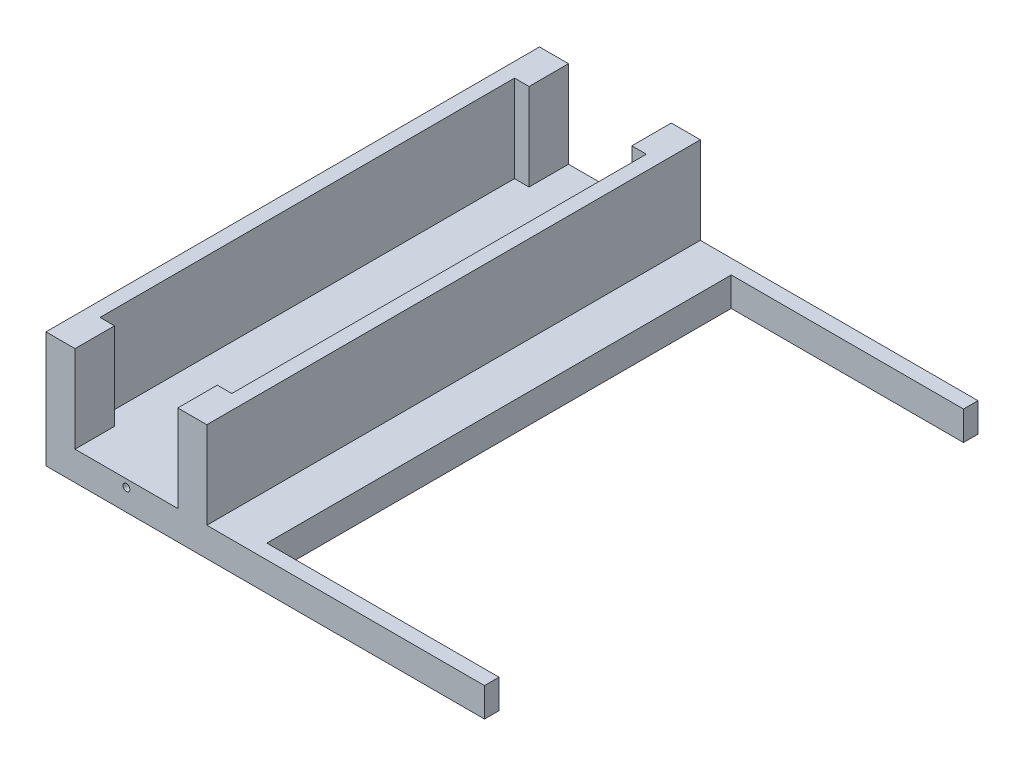
ISO-10303-21;
HEADER;
FILE_DESCRIPTION(('STEP AP214'),'2;1');
FILE_NAME('part.step','',(''),(''),'','','');
FILE_SCHEMA(('AUTOMOTIVE_DESIGN { 1 0 10303 214 1 1 1 1 }'));
ENDSEC;
DATA;
#1=APPLICATION_CONTEXT('core data for automotive mechanical design processes');
#2=APPLICATION_PROTOCOL_DEFINITION('international standard','automotive_design',2000,#1);
#3=PRODUCT_CONTEXT('',#1,'mechanical');
#4=PRODUCT('Part','Part','',(#3));
#5=PRODUCT_RELATED_PRODUCT_CATEGORY('part','',(#4));
#6=PRODUCT_DEFINITION_FORMATION('','',#4);
#7=PRODUCT_DEFINITION_CONTEXT('part definition',#1,'design');
#8=PRODUCT_DEFINITION('design','',#6,#7);
#9=PRODUCT_DEFINITION_SHAPE('','',#8);
#10=(LENGTH_UNIT() NAMED_UNIT(*) SI_UNIT(.MILLI.,.METRE.));
#11=(NAMED_UNIT(*) PLANE_ANGLE_UNIT() SI_UNIT($,.RADIAN.));
#12=(NAMED_UNIT(*) SI_UNIT($,.STERADIAN.) SOLID_ANGLE_UNIT());
#13=UNCERTAINTY_MEASURE_WITH_UNIT(LENGTH_MEASURE(1.E-05),#10,'distance_accuracy_value','');
#14=(GEOMETRIC_REPRESENTATION_CONTEXT(3) GLOBAL_UNCERTAINTY_ASSIGNED_CONTEXT((#13)) GLOBAL_UNIT_ASSIGNED_CONTEXT((#10,
#11,#12)) REPRESENTATION_CONTEXT('',''));
#15=CARTESIAN_POINT('',(0.,0.,0.));
#16=DIRECTION('',(0.,0.,1.));
#17=DIRECTION('',(1.,0.,0.));
#18=AXIS2_PLACEMENT_3D('',#15,#16,#17);
#19=CARTESIAN_POINT('',(0.,0.,0.));
#20=DIRECTION('',(0.,1.,0.));
#21=DIRECTION('',(0.,0.,1.));
#22=AXIS2_PLACEMENT_3D('',#19,#20,#21);
#23=PLANE('',#22);
#24=DIRECTION('',(0.,0.,1.));
#25=VECTOR('',#24,1.);
#26=CARTESIAN_POINT('',(-33.0034526155511,0.,0.));
#27=LINE('',#26,#25);
#28=CARTESIAN_POINT('',(-33.0034526155511,0.,-53.975));
#29=VERTEX_POINT('',#28);
#30=CARTESIAN_POINT('',(-33.0034526155511,0.,-50.8));
#31=VERTEX_POINT('',#30);
#32=EDGE_CURVE('E115',#29,#31,#27,.T.);
#33=ORIENTED_EDGE('',*,*,#32,.F.);
#34=DIRECTION('',(1.,0.,0.));
#35=VECTOR('',#34,1.);
#36=CARTESIAN_POINT('',(0.,0.,-53.975));
#37=LINE('',#36,#35);
#38=CARTESIAN_POINT('',(-93.7425473844489,0.,-53.975));
#39=VERTEX_POINT('',#38);
#40=EDGE_CURVE('E468',#39,#29,#37,.T.);
#41=ORIENTED_EDGE('',*,*,#40,.F.);
#42=DIRECTION('',(0.,0.,1.));
#43=VECTOR('',#42,1.);
#44=CARTESIAN_POINT('',(-93.7425473844489,0.,0.));
#45=LINE('',#44,#43);
#46=CARTESIAN_POINT('',(-93.7425473844489,0.,53.975));
#47=VERTEX_POINT('',#46);
#48=EDGE_CURVE('E301',#39,#47,#45,.T.);
#49=ORIENTED_EDGE('',*,*,#48,.T.);
#50=DIRECTION('',(1.,0.,0.));
#51=VECTOR('',#50,1.);
#52=CARTESIAN_POINT('',(0.,0.,53.975));
#53=LINE('',#52,#51);
#54=CARTESIAN_POINT('',(-33.0034526155511,0.,53.975));
#55=VERTEX_POINT('',#54);
#56=EDGE_CURVE('E452',#47,#55,#53,.T.);
#57=ORIENTED_EDGE('',*,*,#56,.T.);
#58=CARTESIAN_POINT('',(-33.0034526155511,0.,50.8));
#59=VERTEX_POINT('',#58);
#60=EDGE_CURVE('E503',#59,#55,#27,.T.);
#61=ORIENTED_EDGE('',*,*,#60,.F.);
#62=DIRECTION('',(1.,0.,0.));
#63=VECTOR('',#62,1.);
#64=CARTESIAN_POINT('',(0.,0.,50.8));
#65=LINE('',#64,#63);
#66=CARTESIAN_POINT('',(-83.8034526155511,0.,50.8));
#67=VERTEX_POINT('',#66);
#68=EDGE_CURVE('E261',#67,#59,#65,.T.);
#69=ORIENTED_EDGE('',*,*,#68,.F.);
#70=DIRECTION('',(0.,0.,1.));
#71=VECTOR('',#70,1.);
#72=CARTESIAN_POINT('',(-83.8034526155511,0.,0.));
#73=LINE('',#72,#71);
#74=CARTESIAN_POINT('',(-83.8034526155511,0.,-50.8));
#75=VERTEX_POINT('',#74);
#76=EDGE_CURVE('E268',#75,#67,#73,.T.);
#77=ORIENTED_EDGE('',*,*,#76,.F.);
#78=DIRECTION('',(1.,0.,0.));
#79=VECTOR('',#78,1.);
#80=CARTESIAN_POINT('',(0.,0.,-50.8));
#81=LINE('',#80,#79);
#82=EDGE_CURVE('E277',#75,#31,#81,.T.);
#83=ORIENTED_EDGE('',*,*,#82,.T.);
#84=EDGE_LOOP('',(#33,#41,#49,#57,#61,#69,#77,#83));
#85=FACE_BOUND('',#84,.T.);
#86=ADVANCED_FACE('F92',(#85),#23,.T.);
#87=CARTESIAN_POINT('',(0.,-6.35,0.));
#88=DIRECTION('',(0.,1.,0.));
#89=DIRECTION('',(0.,0.,1.));
#90=AXIS2_PLACEMENT_3D('',#87,#88,#89);
#91=PLANE('',#90);
#92=DIRECTION('',(1.,0.,0.));
#93=VECTOR('',#92,1.);
#94=CARTESIAN_POINT('',(0.,-6.35,-53.975));
#95=LINE('',#94,#93);
#96=CARTESIAN_POINT('',(-128.921547384449,-6.35,-53.975));
#97=VERTEX_POINT('',#96);
#98=CARTESIAN_POINT('',(-33.0034526155511,-6.35,-53.975));
#99=VERTEX_POINT('',#98);
#100=EDGE_CURVE('E253',#97,#99,#95,.T.);
#101=ORIENTED_EDGE('',*,*,#100,.T.);
#102=DIRECTION('',(0.,0.,1.));
#103=VECTOR('',#102,1.);
#104=CARTESIAN_POINT('',(-33.0034526155511,-6.35,0.));
#105=LINE('',#104,#103);
#106=CARTESIAN_POINT('',(-33.0034526155511,-6.35,-50.8));
#107=VERTEX_POINT('',#106);
#108=EDGE_CURVE('E240',#99,#107,#105,.T.);
#109=ORIENTED_EDGE('',*,*,#108,.T.);
#110=DIRECTION('',(1.,0.,0.));
#111=VECTOR('',#110,1.);
#112=CARTESIAN_POINT('',(0.,-6.35,-50.8));
#113=LINE('',#112,#111);
#114=CARTESIAN_POINT('',(-83.8034526155511,-6.35,-50.8));
#115=VERTEX_POINT('',#114);
#116=EDGE_CURVE('E251',#115,#107,#113,.T.);
#117=ORIENTED_EDGE('',*,*,#116,.F.);
#118=DIRECTION('',(0.,0.,1.));
#119=VECTOR('',#118,1.);
#120=CARTESIAN_POINT('',(-83.8034526155511,-6.35,0.));
#121=LINE('',#120,#119);
#122=CARTESIAN_POINT('',(-83.8034526155511,-6.35,50.8));
#123=VERTEX_POINT('',#122);
#124=EDGE_CURVE('E260',#115,#123,#121,.T.);
#125=ORIENTED_EDGE('',*,*,#124,.T.);
#126=DIRECTION('',(1.,0.,0.));
#127=VECTOR('',#126,1.);
#128=CARTESIAN_POINT('',(0.,-6.35,50.8));
#129=LINE('',#128,#127);
#130=CARTESIAN_POINT('',(-33.0034526155511,-6.35,50.8));
#131=VERTEX_POINT('',#130);
#132=EDGE_CURVE('E265',#123,#131,#129,.T.);
#133=ORIENTED_EDGE('',*,*,#132,.T.);
#134=CARTESIAN_POINT('',(-33.0034526155511,-6.35,53.975));
#135=VERTEX_POINT('',#134);
#136=EDGE_CURVE('E108',#131,#135,#105,.T.);
#137=ORIENTED_EDGE('',*,*,#136,.T.);
#138=DIRECTION('',(1.,0.,0.));
#139=VECTOR('',#138,1.);
#140=CARTESIAN_POINT('',(0.,-6.35,53.975));
#141=LINE('',#140,#139);
#142=CARTESIAN_POINT('',(-128.921547384449,-6.35,53.975));
#143=VERTEX_POINT('',#142);
#144=EDGE_CURVE('E456',#143,#135,#141,.T.);
#145=ORIENTED_EDGE('',*,*,#144,.F.);
#146=DIRECTION('',(0.,0.,-1.));
#147=VECTOR('',#146,1.);
#148=CARTESIAN_POINT('',(-128.921547384449,-6.35,0.));
#149=LINE('',#148,#147);
#150=EDGE_CURVE('E453',#143,#97,#149,.T.);
#151=ORIENTED_EDGE('',*,*,#150,.T.);
#152=EDGE_LOOP('',(#101,#109,#117,#125,#133,#137,#145,#151));
#153=FACE_BOUND('',#152,.T.);
#154=ADVANCED_FACE('F249',(#153),#91,.F.);
#155=DIRECTION('',(1.,0.,0.));
#156=VECTOR('',#155,1.);
#157=CARTESIAN_POINT('',(0.,0.,-45.339));
#158=LINE('',#157,#156);
#159=CARTESIAN_POINT('',(-100.092547384449,0.,-45.339));
#160=VERTEX_POINT('',#159);
#161=CARTESIAN_POINT('',(-96.9175473844489,0.,-45.339));
#162=VERTEX_POINT('',#161);
#163=EDGE_CURVE('E342',#160,#162,#158,.T.);
#164=ORIENTED_EDGE('',*,*,#163,.F.);
#165=DIRECTION('',(0.,0.,1.));
#166=VECTOR('',#165,1.);
#167=CARTESIAN_POINT('',(-100.092547384449,0.,0.));
#168=LINE('',#167,#166);
#169=CARTESIAN_POINT('',(-100.092547384449,0.,-53.975));
#170=VERTEX_POINT('',#169);
#171=EDGE_CURVE('E339',#170,#160,#168,.T.);
#172=ORIENTED_EDGE('',*,*,#171,.F.);
#173=CARTESIAN_POINT('',(-122.571547384449,0.,-53.975));
#174=VERTEX_POINT('',#173);
#175=EDGE_CURVE('E457',#174,#170,#37,.T.);
#176=ORIENTED_EDGE('',*,*,#175,.F.);
#177=DIRECTION('',(0.,0.,1.));
#178=VECTOR('',#177,1.);
#179=CARTESIAN_POINT('',(-122.571547384449,0.,0.));
#180=LINE('',#179,#178);
#181=CARTESIAN_POINT('',(-122.571547384449,0.,-45.339));
#182=VERTEX_POINT('',#181);
#183=EDGE_CURVE('E382',#174,#182,#180,.T.);
#184=ORIENTED_EDGE('',*,*,#183,.T.);
#185=DIRECTION('',(1.,0.,0.));
#186=VECTOR('',#185,1.);
#187=CARTESIAN_POINT('',(0.,0.,-45.339));
#188=LINE('',#187,#186);
#189=CARTESIAN_POINT('',(-125.746547384449,0.,-45.339));
#190=VERTEX_POINT('',#189);
#191=EDGE_CURVE('E388',#190,#182,#188,.T.);
#192=ORIENTED_EDGE('',*,*,#191,.F.);
#193=DIRECTION('',(0.,0.,-1.));
#194=VECTOR('',#193,1.);
#195=CARTESIAN_POINT('',(-125.746547384449,0.,0.));
#196=LINE('',#195,#194);
#197=CARTESIAN_POINT('',(-125.746547384449,0.,45.339));
#198=VERTEX_POINT('',#197);
#199=EDGE_CURVE('E422',#198,#190,#196,.T.);
#200=ORIENTED_EDGE('',*,*,#199,.F.);
#201=DIRECTION('',(1.,0.,0.));
#202=VECTOR('',#201,1.);
#203=CARTESIAN_POINT('',(0.,0.,45.339));
#204=LINE('',#203,#202);
#205=CARTESIAN_POINT('',(-122.571547384449,0.,45.339));
#206=VERTEX_POINT('',#205);
#207=EDGE_CURVE('E419',#198,#206,#204,.T.);
#208=ORIENTED_EDGE('',*,*,#207,.T.);
#209=DIRECTION('',(0.,0.,-1.));
#210=VECTOR('',#209,1.);
#211=CARTESIAN_POINT('',(-122.571547384449,0.,0.));
#212=LINE('',#211,#210);
#213=CARTESIAN_POINT('',(-122.571547384449,0.,53.975));
#214=VERTEX_POINT('',#213);
#215=EDGE_CURVE('E415',#214,#206,#212,.T.);
#216=ORIENTED_EDGE('',*,*,#215,.F.);
#217=CARTESIAN_POINT('',(-100.092547384449,0.,53.975));
#218=VERTEX_POINT('',#217);
#219=EDGE_CURVE('E464',#214,#218,#53,.T.);
#220=ORIENTED_EDGE('',*,*,#219,.T.);
#221=DIRECTION('',(0.,0.,-1.));
#222=VECTOR('',#221,1.);
#223=CARTESIAN_POINT('',(-100.092547384449,0.,0.));
#224=LINE('',#223,#222);
#225=CARTESIAN_POINT('',(-100.092547384449,0.,45.339));
#226=VERTEX_POINT('',#225);
#227=EDGE_CURVE('E310',#218,#226,#224,.T.);
#228=ORIENTED_EDGE('',*,*,#227,.T.);
#229=DIRECTION('',(1.,0.,0.));
#230=VECTOR('',#229,1.);
#231=CARTESIAN_POINT('',(0.,0.,45.339));
#232=LINE('',#231,#230);
#233=CARTESIAN_POINT('',(-96.9175473844489,0.,45.339));
#234=VERTEX_POINT('',#233);
#235=EDGE_CURVE('E350',#226,#234,#232,.T.);
#236=ORIENTED_EDGE('',*,*,#235,.T.);
#237=DIRECTION('',(0.,0.,-1.));
#238=VECTOR('',#237,1.);
#239=CARTESIAN_POINT('',(-96.9175473844489,0.,0.));
#240=LINE('',#239,#238);
#241=EDGE_CURVE('E346',#234,#162,#240,.T.);
#242=ORIENTED_EDGE('',*,*,#241,.T.);
#243=EDGE_LOOP('',(#164,#172,#176,#184,#192,#200,#208,#216,#220,#228,#236,#242));
#244=FACE_BOUND('',#243,.T.);
#245=ADVANCED_FACE('F533',(#244),#23,.T.);
#246=CARTESIAN_POINT('',(-128.921547384449,-6.35,0.));
#247=DIRECTION('',(1.,0.,0.));
#248=DIRECTION('',(0.,0.,-1.));
#249=AXIS2_PLACEMENT_3D('',#246,#247,#248);
#250=PLANE('',#249);
#251=DIRECTION('',(0.,1.,0.));
#252=VECTOR('',#251,1.);
#253=CARTESIAN_POINT('',(-128.921547384449,-6.35,53.975));
#254=LINE('',#253,#252);
#255=CARTESIAN_POINT('',(-128.921547384449,19.05,53.975));
#256=VERTEX_POINT('',#255);
#257=EDGE_CURVE('E463',#143,#256,#254,.T.);
#258=ORIENTED_EDGE('',*,*,#257,.T.);
#259=DIRECTION('',(0.,0.,-1.));
#260=VECTOR('',#259,1.);
#261=CARTESIAN_POINT('',(-128.921547384449,19.05,0.));
#262=LINE('',#261,#260);
#263=CARTESIAN_POINT('',(-128.921547384449,19.05,-53.975));
#264=VERTEX_POINT('',#263);
#265=EDGE_CURVE('E392',#256,#264,#262,.T.);
#266=ORIENTED_EDGE('',*,*,#265,.T.);
#267=DIRECTION('',(0.,1.,0.));
#268=VECTOR('',#267,1.);
#269=CARTESIAN_POINT('',(-128.921547384449,-6.35,-53.975));
#270=LINE('',#269,#268);
#271=EDGE_CURVE('E101',#97,#264,#270,.T.);
#272=ORIENTED_EDGE('',*,*,#271,.F.);
#273=ORIENTED_EDGE('',*,*,#150,.F.);
#274=EDGE_LOOP('',(#258,#266,#272,#273));
#275=FACE_BOUND('',#274,.T.);
#276=ADVANCED_FACE('F477',(#275),#250,.F.);
#277=CARTESIAN_POINT('',(0.,-6.35,53.975));
#278=DIRECTION('',(0.,0.,1.));
#279=DIRECTION('',(1.,0.,0.));
#280=AXIS2_PLACEMENT_3D('',#277,#278,#279);
#281=PLANE('',#280);
#282=DIRECTION('',(0.,-1.,0.));
#283=VECTOR('',#282,1.);
#284=CARTESIAN_POINT('',(-33.0034526155511,-6.35,53.975));
#285=LINE('',#284,#283);
#286=EDGE_CURVE('E271',#55,#135,#285,.T.);
#287=ORIENTED_EDGE('',*,*,#286,.F.);
#288=ORIENTED_EDGE('',*,*,#56,.F.);
#289=DIRECTION('',(0.,-1.,0.));
#290=VECTOR('',#289,1.);
#291=CARTESIAN_POINT('',(-93.7425473844489,19.05,53.975));
#292=LINE('',#291,#290);
#293=CARTESIAN_POINT('',(-93.7425473844489,19.05,53.975));
#294=VERTEX_POINT('',#293);
#295=EDGE_CURVE('E335',#294,#47,#292,.T.);
#296=ORIENTED_EDGE('',*,*,#295,.F.);
#297=DIRECTION('',(1.,0.,0.));
#298=VECTOR('',#297,1.);
#299=CARTESIAN_POINT('',(0.,19.05,53.975));
#300=LINE('',#299,#298);
#301=CARTESIAN_POINT('',(-100.092547384449,19.05,53.975));
#302=VERTEX_POINT('',#301);
#303=EDGE_CURVE('E332',#302,#294,#300,.T.);
#304=ORIENTED_EDGE('',*,*,#303,.F.);
#305=DIRECTION('',(0.,-1.,0.));
#306=VECTOR('',#305,1.);
#307=CARTESIAN_POINT('',(-100.092547384449,19.05,53.975));
#308=LINE('',#307,#306);
#309=EDGE_CURVE('E359',#302,#218,#308,.T.);
#310=ORIENTED_EDGE('',*,*,#309,.T.);
#311=ORIENTED_EDGE('',*,*,#219,.F.);
#312=DIRECTION('',(0.,-1.,0.));
#313=VECTOR('',#312,1.);
#314=CARTESIAN_POINT('',(-122.571547384449,19.05,53.975));
#315=LINE('',#314,#313);
#316=CARTESIAN_POINT('',(-122.571547384449,19.05,53.975));
#317=VERTEX_POINT('',#316);
#318=EDGE_CURVE('E444',#317,#214,#315,.T.);
#319=ORIENTED_EDGE('',*,*,#318,.F.);
#320=DIRECTION('',(1.,0.,0.));
#321=VECTOR('',#320,1.);
#322=CARTESIAN_POINT('',(0.,19.05,53.975));
#323=LINE('',#322,#321);
#324=EDGE_CURVE('E396',#256,#317,#323,.T.);
#325=ORIENTED_EDGE('',*,*,#324,.F.);
#326=ORIENTED_EDGE('',*,*,#257,.F.);
#327=ORIENTED_EDGE('',*,*,#144,.T.);
#328=EDGE_LOOP('',(#287,#288,#296,#304,#310,#311,#319,#325,#326,#327));
#329=FACE_BOUND('',#328,.T.);
#330=CARTESIAN_POINT('',(-111.332047384449,-1.651,53.975));
#331=DIRECTION('',(0.,0.,1.));
#332=DIRECTION('',(1.,0.,0.));
#333=AXIS2_PLACEMENT_3D('',#330,#331,#332);
#334=CIRCLE('',#333,0.762000000000003);
#335=CARTESIAN_POINT('',(-110.570047384449,-1.651,53.975));
#336=VERTEX_POINT('',#335);
#337=EDGE_CURVE('E293',#336,#336,#334,.T.);
#338=ORIENTED_EDGE('',*,*,#337,.F.);
#339=EDGE_LOOP('',(#338));
#340=FACE_BOUND('',#339,.T.);
#341=ADVANCED_FACE('F94',(#329,#340),#281,.T.);
#342=CARTESIAN_POINT('',(0.,-6.35,-53.975));
#343=DIRECTION('',(0.,0.,1.));
#344=DIRECTION('',(1.,0.,0.));
#345=AXIS2_PLACEMENT_3D('',#342,#343,#344);
#346=PLANE('',#345);
#347=CARTESIAN_POINT('',(-111.332047384449,-1.651,-53.975));
#348=DIRECTION('',(0.,0.,1.));
#349=DIRECTION('',(1.,0.,0.));
#350=AXIS2_PLACEMENT_3D('',#347,#348,#349);
#351=CIRCLE('',#350,0.762000000000003);
#352=CARTESIAN_POINT('',(-110.570047384449,-1.651,-53.975));
#353=VERTEX_POINT('',#352);
#354=EDGE_CURVE('E286',#353,#353,#351,.T.);
#355=ORIENTED_EDGE('',*,*,#354,.T.);
#356=EDGE_LOOP('',(#355));
#357=FACE_BOUND('',#356,.T.);
#358=ORIENTED_EDGE('',*,*,#40,.T.);
#359=DIRECTION('',(0.,-1.,0.));
#360=VECTOR('',#359,1.);
#361=CARTESIAN_POINT('',(-33.0034526155511,-6.35,-53.975));
#362=LINE('',#361,#360);
#363=EDGE_CURVE('E495',#29,#99,#362,.T.);
#364=ORIENTED_EDGE('',*,*,#363,.T.);
#365=ORIENTED_EDGE('',*,*,#100,.F.);
#366=ORIENTED_EDGE('',*,*,#271,.T.);
#367=DIRECTION('',(1.,0.,0.));
#368=VECTOR('',#367,1.);
#369=CARTESIAN_POINT('',(0.,19.05,-53.975));
#370=LINE('',#369,#368);
#371=CARTESIAN_POINT('',(-122.571547384449,19.05,-53.975));
#372=VERTEX_POINT('',#371);
#373=EDGE_CURVE('E387',#264,#372,#370,.T.);
#374=ORIENTED_EDGE('',*,*,#373,.T.);
#375=DIRECTION('',(0.,-1.,0.));
#376=VECTOR('',#375,1.);
#377=CARTESIAN_POINT('',(-122.571547384449,19.05,-53.975));
#378=LINE('',#377,#376);
#379=EDGE_CURVE('E448',#372,#174,#378,.T.);
#380=ORIENTED_EDGE('',*,*,#379,.T.);
#381=ORIENTED_EDGE('',*,*,#175,.T.);
#382=DIRECTION('',(0.,-1.,0.));
#383=VECTOR('',#382,1.);
#384=CARTESIAN_POINT('',(-100.092547384449,19.05,-53.975));
#385=LINE('',#384,#383);
#386=CARTESIAN_POINT('',(-100.092547384449,19.05,-53.975));
#387=VERTEX_POINT('',#386);
#388=EDGE_CURVE('E375',#387,#170,#385,.T.);
#389=ORIENTED_EDGE('',*,*,#388,.F.);
#390=DIRECTION('',(1.,0.,0.));
#391=VECTOR('',#390,1.);
#392=CARTESIAN_POINT('',(0.,19.05,-53.975));
#393=LINE('',#392,#391);
#394=CARTESIAN_POINT('',(-93.7425473844489,19.05,-53.975));
#395=VERTEX_POINT('',#394);
#396=EDGE_CURVE('E309',#387,#395,#393,.T.);
#397=ORIENTED_EDGE('',*,*,#396,.T.);
#398=DIRECTION('',(0.,-1.,0.));
#399=VECTOR('',#398,1.);
#400=CARTESIAN_POINT('',(-93.7425473844489,19.05,-53.975));
#401=LINE('',#400,#399);
#402=EDGE_CURVE('E378',#395,#39,#401,.T.);
#403=ORIENTED_EDGE('',*,*,#402,.T.);
#404=EDGE_LOOP('',(#358,#364,#365,#366,#374,#380,#381,#389,#397,#403));
#405=FACE_BOUND('',#404,.T.);
#406=ADVANCED_FACE('F493',(#357,#405),#346,.F.);
#407=CARTESIAN_POINT('',(-122.571547384449,19.05,0.));
#408=DIRECTION('',(1.,0.,0.));
#409=DIRECTION('',(0.,0.,-1.));
#410=AXIS2_PLACEMENT_3D('',#407,#408,#409);
#411=PLANE('',#410);
#412=ORIENTED_EDGE('',*,*,#183,.F.);
#413=ORIENTED_EDGE('',*,*,#379,.F.);
#414=DIRECTION('',(0.,0.,1.));
#415=VECTOR('',#414,1.);
#416=CARTESIAN_POINT('',(-122.571547384449,19.05,0.));
#417=LINE('',#416,#415);
#418=CARTESIAN_POINT('',(-122.571547384449,19.05,-45.339));
#419=VERTEX_POINT('',#418);
#420=EDGE_CURVE('E383',#372,#419,#417,.T.);
#421=ORIENTED_EDGE('',*,*,#420,.T.);
#422=DIRECTION('',(0.,-1.,0.));
#423=VECTOR('',#422,1.);
#424=CARTESIAN_POINT('',(-122.571547384449,19.05,-45.339));
#425=LINE('',#424,#423);
#426=EDGE_CURVE('E412',#419,#182,#425,.T.);
#427=ORIENTED_EDGE('',*,*,#426,.T.);
#428=EDGE_LOOP('',(#412,#413,#421,#427));
#429=FACE_BOUND('',#428,.T.);
#430=ADVANCED_FACE('F550',(#429),#411,.T.);
#431=CARTESIAN_POINT('',(-122.571547384449,19.05,0.));
#432=DIRECTION('',(-1.,0.,0.));
#433=DIRECTION('',(0.,0.,1.));
#434=AXIS2_PLACEMENT_3D('',#431,#432,#433);
#435=PLANE('',#434);
#436=ORIENTED_EDGE('',*,*,#215,.T.);
#437=DIRECTION('',(0.,-1.,0.));
#438=VECTOR('',#437,1.);
#439=CARTESIAN_POINT('',(-122.571547384449,19.05,45.339));
#440=LINE('',#439,#438);
#441=CARTESIAN_POINT('',(-122.571547384449,19.05,45.339));
#442=VERTEX_POINT('',#441);
#443=EDGE_CURVE('E440',#442,#206,#440,.T.);
#444=ORIENTED_EDGE('',*,*,#443,.F.);
#445=DIRECTION('',(0.,0.,-1.));
#446=VECTOR('',#445,1.);
#447=CARTESIAN_POINT('',(-122.571547384449,19.05,0.));
#448=LINE('',#447,#446);
#449=EDGE_CURVE('E399',#317,#442,#448,.T.);
#450=ORIENTED_EDGE('',*,*,#449,.F.);
#451=ORIENTED_EDGE('',*,*,#318,.T.);
#452=EDGE_LOOP('',(#436,#444,#450,#451));
#453=FACE_BOUND('',#452,.T.);
#454=ADVANCED_FACE('F537',(#453),#435,.F.);
#455=CARTESIAN_POINT('',(0.,19.05,45.339));
#456=DIRECTION('',(0.,0.,-1.));
#457=DIRECTION('',(-1.,0.,0.));
#458=AXIS2_PLACEMENT_3D('',#455,#456,#457);
#459=PLANE('',#458);
#460=ORIENTED_EDGE('',*,*,#207,.F.);
#461=DIRECTION('',(0.,-1.,0.));
#462=VECTOR('',#461,1.);
#463=CARTESIAN_POINT('',(-125.746547384449,19.05,45.339));
#464=LINE('',#463,#462);
#465=CARTESIAN_POINT('',(-125.746547384449,19.05,45.339));
#466=VERTEX_POINT('',#465);
#467=EDGE_CURVE('E436',#466,#198,#464,.T.);
#468=ORIENTED_EDGE('',*,*,#467,.F.);
#469=DIRECTION('',(1.,0.,0.));
#470=VECTOR('',#469,1.);
#471=CARTESIAN_POINT('',(0.,19.05,45.339));
#472=LINE('',#471,#470);
#473=EDGE_CURVE('E402',#466,#442,#472,.T.);
#474=ORIENTED_EDGE('',*,*,#473,.T.);
#475=ORIENTED_EDGE('',*,*,#443,.T.);
#476=EDGE_LOOP('',(#460,#468,#474,#475));
#477=FACE_BOUND('',#476,.T.);
#478=ADVANCED_FACE('F542',(#477),#459,.T.);
#479=CARTESIAN_POINT('',(-125.746547384449,19.05,0.));
#480=DIRECTION('',(-1.,0.,0.));
#481=DIRECTION('',(0.,0.,1.));
#482=AXIS2_PLACEMENT_3D('',#479,#480,#481);
#483=PLANE('',#482);
#484=ORIENTED_EDGE('',*,*,#199,.T.);
#485=DIRECTION('',(0.,-1.,0.));
#486=VECTOR('',#485,1.);
#487=CARTESIAN_POINT('',(-125.746547384449,19.05,-45.339));
#488=LINE('',#487,#486);
#489=CARTESIAN_POINT('',(-125.746547384449,19.05,-45.339));
#490=VERTEX_POINT('',#489);
#491=EDGE_CURVE('E432',#490,#190,#488,.T.);
#492=ORIENTED_EDGE('',*,*,#491,.F.);
#493=DIRECTION('',(0.,0.,-1.));
#494=VECTOR('',#493,1.);
#495=CARTESIAN_POINT('',(-125.746547384449,19.05,0.));
#496=LINE('',#495,#494);
#497=EDGE_CURVE('E406',#466,#490,#496,.T.);
#498=ORIENTED_EDGE('',*,*,#497,.F.);
#499=ORIENTED_EDGE('',*,*,#467,.T.);
#500=EDGE_LOOP('',(#484,#492,#498,#499));
#501=FACE_BOUND('',#500,.T.);
#502=ADVANCED_FACE('F544',(#501),#483,.F.);
#503=CARTESIAN_POINT('',(0.,19.05,-45.339));
#504=DIRECTION('',(0.,0.,-1.));
#505=DIRECTION('',(-1.,0.,0.));
#506=AXIS2_PLACEMENT_3D('',#503,#504,#505);
#507=PLANE('',#506);
#508=ORIENTED_EDGE('',*,*,#191,.T.);
#509=ORIENTED_EDGE('',*,*,#426,.F.);
#510=DIRECTION('',(1.,0.,0.));
#511=VECTOR('',#510,1.);
#512=CARTESIAN_POINT('',(0.,19.05,-45.339));
#513=LINE('',#512,#511);
#514=EDGE_CURVE('E409',#490,#419,#513,.T.);
#515=ORIENTED_EDGE('',*,*,#514,.F.);
#516=ORIENTED_EDGE('',*,*,#491,.T.);
#517=EDGE_LOOP('',(#508,#509,#515,#516));
#518=FACE_BOUND('',#517,.T.);
#519=ADVANCED_FACE('F548',(#518),#507,.F.);
#520=CARTESIAN_POINT('',(0.,19.05,0.));
#521=DIRECTION('',(0.,1.,0.));
#522=DIRECTION('',(0.,0.,1.));
#523=AXIS2_PLACEMENT_3D('',#520,#521,#522);
#524=PLANE('',#523);
#525=ORIENTED_EDGE('',*,*,#420,.F.);
#526=ORIENTED_EDGE('',*,*,#373,.F.);
#527=ORIENTED_EDGE('',*,*,#265,.F.);
#528=ORIENTED_EDGE('',*,*,#324,.T.);
#529=ORIENTED_EDGE('',*,*,#449,.T.);
#530=ORIENTED_EDGE('',*,*,#473,.F.);
#531=ORIENTED_EDGE('',*,*,#497,.T.);
#532=ORIENTED_EDGE('',*,*,#514,.T.);
#533=EDGE_LOOP('',(#525,#526,#527,#528,#529,#530,#531,#532));
#534=FACE_BOUND('',#533,.T.);
#535=ADVANCED_FACE('F490',(#534),#524,.T.);
#536=CARTESIAN_POINT('',(-93.7425473844489,19.05,0.));
#537=DIRECTION('',(1.,0.,0.));
#538=DIRECTION('',(0.,0.,-1.));
#539=AXIS2_PLACEMENT_3D('',#536,#537,#538);
#540=PLANE('',#539);
#541=ORIENTED_EDGE('',*,*,#48,.F.);
#542=ORIENTED_EDGE('',*,*,#402,.F.);
#543=DIRECTION('',(0.,0.,1.));
#544=VECTOR('',#543,1.);
#545=CARTESIAN_POINT('',(-93.7425473844489,19.05,0.));
#546=LINE('',#545,#544);
#547=EDGE_CURVE('E305',#395,#294,#546,.T.);
#548=ORIENTED_EDGE('',*,*,#547,.T.);
#549=ORIENTED_EDGE('',*,*,#295,.T.);
#550=EDGE_LOOP('',(#541,#542,#548,#549));
#551=FACE_BOUND('',#550,.T.);
#552=ADVANCED_FACE('F517',(#551),#540,.T.);
#553=CARTESIAN_POINT('',(-100.092547384449,19.05,0.));
#554=DIRECTION('',(1.,0.,0.));
#555=DIRECTION('',(0.,0.,-1.));
#556=AXIS2_PLACEMENT_3D('',#553,#554,#555);
#557=PLANE('',#556);
#558=ORIENTED_EDGE('',*,*,#171,.T.);
#559=DIRECTION('',(0.,-1.,0.));
#560=VECTOR('',#559,1.);
#561=CARTESIAN_POINT('',(-100.092547384449,19.05,-45.339));
#562=LINE('',#561,#560);
#563=CARTESIAN_POINT('',(-100.092547384449,19.05,-45.339));
#564=VERTEX_POINT('',#563);
#565=EDGE_CURVE('E371',#564,#160,#562,.T.);
#566=ORIENTED_EDGE('',*,*,#565,.F.);
#567=DIRECTION('',(0.,0.,1.));
#568=VECTOR('',#567,1.);
#569=CARTESIAN_POINT('',(-100.092547384449,19.05,0.));
#570=LINE('',#569,#568);
#571=EDGE_CURVE('E314',#387,#564,#570,.T.);
#572=ORIENTED_EDGE('',*,*,#571,.F.);
#573=ORIENTED_EDGE('',*,*,#388,.T.);
#574=EDGE_LOOP('',(#558,#566,#572,#573));
#575=FACE_BOUND('',#574,.T.);
#576=ADVANCED_FACE('F553',(#575),#557,.F.);
#577=CARTESIAN_POINT('',(0.,19.05,-45.339));
#578=DIRECTION('',(0.,0.,-1.));
#579=DIRECTION('',(-1.,0.,0.));
#580=AXIS2_PLACEMENT_3D('',#577,#578,#579);
#581=PLANE('',#580);
#582=ORIENTED_EDGE('',*,*,#163,.T.);
#583=DIRECTION('',(0.,-1.,0.));
#584=VECTOR('',#583,1.);
#585=CARTESIAN_POINT('',(-96.9175473844489,19.05,-45.339));
#586=LINE('',#585,#584);
#587=CARTESIAN_POINT('',(-96.9175473844489,19.05,-45.339));
#588=VERTEX_POINT('',#587);
#589=EDGE_CURVE('E368',#588,#162,#586,.T.);
#590=ORIENTED_EDGE('',*,*,#589,.F.);
#591=DIRECTION('',(1.,0.,0.));
#592=VECTOR('',#591,1.);
#593=CARTESIAN_POINT('',(0.,19.05,-45.339));
#594=LINE('',#593,#592);
#595=EDGE_CURVE('E317',#564,#588,#594,.T.);
#596=ORIENTED_EDGE('',*,*,#595,.F.);
#597=ORIENTED_EDGE('',*,*,#565,.T.);
#598=EDGE_LOOP('',(#582,#590,#596,#597));
#599=FACE_BOUND('',#598,.T.);
#600=ADVANCED_FACE('F556',(#599),#581,.F.);
#601=CARTESIAN_POINT('',(-96.9175473844489,19.05,0.));
#602=DIRECTION('',(-1.,0.,0.));
#603=DIRECTION('',(0.,0.,1.));
#604=AXIS2_PLACEMENT_3D('',#601,#602,#603);
#605=PLANE('',#604);
#606=ORIENTED_EDGE('',*,*,#241,.F.);
#607=DIRECTION('',(0.,-1.,0.));
#608=VECTOR('',#607,1.);
#609=CARTESIAN_POINT('',(-96.9175473844489,19.05,45.339));
#610=LINE('',#609,#608);
#611=CARTESIAN_POINT('',(-96.9175473844489,19.05,45.339));
#612=VERTEX_POINT('',#611);
#613=EDGE_CURVE('E365',#612,#234,#610,.T.);
#614=ORIENTED_EDGE('',*,*,#613,.F.);
#615=DIRECTION('',(0.,0.,-1.));
#616=VECTOR('',#615,1.);
#617=CARTESIAN_POINT('',(-96.9175473844489,19.05,0.));
#618=LINE('',#617,#616);
#619=EDGE_CURVE('E320',#612,#588,#618,.T.);
#620=ORIENTED_EDGE('',*,*,#619,.T.);
#621=ORIENTED_EDGE('',*,*,#589,.T.);
#622=EDGE_LOOP('',(#606,#614,#620,#621));
#623=FACE_BOUND('',#622,.T.);
#624=ADVANCED_FACE('F563',(#623),#605,.T.);
#625=CARTESIAN_POINT('',(0.,19.05,45.339));
#626=DIRECTION('',(0.,0.,-1.));
#627=DIRECTION('',(-1.,0.,0.));
#628=AXIS2_PLACEMENT_3D('',#625,#626,#627);
#629=PLANE('',#628);
#630=ORIENTED_EDGE('',*,*,#235,.F.);
#631=DIRECTION('',(0.,-1.,0.));
#632=VECTOR('',#631,1.);
#633=CARTESIAN_POINT('',(-100.092547384449,19.05,45.339));
#634=LINE('',#633,#632);
#635=CARTESIAN_POINT('',(-100.092547384449,19.05,45.339));
#636=VERTEX_POINT('',#635);
#637=EDGE_CURVE('E362',#636,#226,#634,.T.);
#638=ORIENTED_EDGE('',*,*,#637,.F.);
#639=DIRECTION('',(1.,0.,0.));
#640=VECTOR('',#639,1.);
#641=CARTESIAN_POINT('',(0.,19.05,45.339));
#642=LINE('',#641,#640);
#643=EDGE_CURVE('E324',#636,#612,#642,.T.);
#644=ORIENTED_EDGE('',*,*,#643,.T.);
#645=ORIENTED_EDGE('',*,*,#613,.T.);
#646=EDGE_LOOP('',(#630,#638,#644,#645));
#647=FACE_BOUND('',#646,.T.);
#648=ADVANCED_FACE('F561',(#647),#629,.T.);
#649=CARTESIAN_POINT('',(-100.092547384449,19.05,0.));
#650=DIRECTION('',(-1.,0.,0.));
#651=DIRECTION('',(0.,0.,1.));
#652=AXIS2_PLACEMENT_3D('',#649,#650,#651);
#653=PLANE('',#652);
#654=ORIENTED_EDGE('',*,*,#227,.F.);
#655=ORIENTED_EDGE('',*,*,#309,.F.);
#656=DIRECTION('',(0.,0.,-1.));
#657=VECTOR('',#656,1.);
#658=CARTESIAN_POINT('',(-100.092547384449,19.05,0.));
#659=LINE('',#658,#657);
#660=EDGE_CURVE('E328',#302,#636,#659,.T.);
#661=ORIENTED_EDGE('',*,*,#660,.T.);
#662=ORIENTED_EDGE('',*,*,#637,.T.);
#663=EDGE_LOOP('',(#654,#655,#661,#662));
#664=FACE_BOUND('',#663,.T.);
#665=ADVANCED_FACE('F529',(#664),#653,.T.);
#666=CARTESIAN_POINT('',(0.,19.05,0.));
#667=DIRECTION('',(0.,1.,0.));
#668=DIRECTION('',(0.,0.,1.));
#669=AXIS2_PLACEMENT_3D('',#666,#667,#668);
#670=PLANE('',#669);
#671=ORIENTED_EDGE('',*,*,#547,.F.);
#672=ORIENTED_EDGE('',*,*,#396,.F.);
#673=ORIENTED_EDGE('',*,*,#571,.T.);
#674=ORIENTED_EDGE('',*,*,#595,.T.);
#675=ORIENTED_EDGE('',*,*,#619,.F.);
#676=ORIENTED_EDGE('',*,*,#643,.F.);
#677=ORIENTED_EDGE('',*,*,#660,.F.);
#678=ORIENTED_EDGE('',*,*,#303,.T.);
#679=EDGE_LOOP('',(#671,#672,#673,#674,#675,#676,#677,#678));
#680=FACE_BOUND('',#679,.T.);
#681=ADVANCED_FACE('F522',(#680),#670,.T.);
#682=CARTESIAN_POINT('',(-111.332047384449,-1.651,47.625));
#683=DIRECTION('',(0.,0.,1.));
#684=DIRECTION('',(1.,0.,0.));
#685=AXIS2_PLACEMENT_3D('',#682,#683,#684);
#686=CYLINDRICAL_SURFACE('',#685,0.762000000000003);
#687=CARTESIAN_POINT('',(-111.332047384449,-1.651,47.625));
#688=DIRECTION('',(0.,0.,1.));
#689=DIRECTION('',(1.,0.,0.));
#690=AXIS2_PLACEMENT_3D('',#687,#688,#689);
#691=CIRCLE('',#690,0.762000000000003);
#692=CARTESIAN_POINT('',(-110.570047384449,-1.651,47.625));
#693=VERTEX_POINT('',#692);
#694=EDGE_CURVE('E297',#693,#693,#691,.T.);
#695=ORIENTED_EDGE('',*,*,#694,.F.);
#696=EDGE_LOOP('',(#695));
#697=FACE_BOUND('',#696,.T.);
#698=ORIENTED_EDGE('',*,*,#337,.T.);
#699=EDGE_LOOP('',(#698));
#700=FACE_BOUND('',#699,.T.);
#701=ADVANCED_FACE('F611',(#697,#700),#686,.F.);
#702=CARTESIAN_POINT('',(-111.332047384449,-1.651,47.625));
#703=DIRECTION('',(0.,0.,1.));
#704=DIRECTION('',(1.,0.,0.));
#705=AXIS2_PLACEMENT_3D('',#702,#703,#704);
#706=PLANE('',#705);
#707=ORIENTED_EDGE('',*,*,#694,.T.);
#708=EDGE_LOOP('',(#707));
#709=FACE_BOUND('',#708,.T.);
#710=ADVANCED_FACE('F601',(#709),#706,.T.);
#711=CARTESIAN_POINT('',(-111.332047384449,-1.651,-47.625));
#712=DIRECTION('',(0.,0.,-1.));
#713=DIRECTION('',(-1.,0.,0.));
#714=AXIS2_PLACEMENT_3D('',#711,#712,#713);
#715=CYLINDRICAL_SURFACE('',#714,0.762000000000003);
#716=CARTESIAN_POINT('',(-111.332047384449,-1.651,-47.625));
#717=DIRECTION('',(0.,0.,1.));
#718=DIRECTION('',(1.,0.,0.));
#719=AXIS2_PLACEMENT_3D('',#716,#717,#718);
#720=CIRCLE('',#719,0.762000000000003);
#721=CARTESIAN_POINT('',(-110.570047384449,-1.651,-47.625));
#722=VERTEX_POINT('',#721);
#723=EDGE_CURVE('E289',#722,#722,#720,.T.);
#724=ORIENTED_EDGE('',*,*,#723,.T.);
#725=EDGE_LOOP('',(#724));
#726=FACE_BOUND('',#725,.T.);
#727=ORIENTED_EDGE('',*,*,#354,.F.);
#728=EDGE_LOOP('',(#727));
#729=FACE_BOUND('',#728,.T.);
#730=ADVANCED_FACE('F598',(#726,#729),#715,.F.);
#731=CARTESIAN_POINT('',(-111.332047384449,-1.651,-47.625));
#732=DIRECTION('',(0.,0.,-1.));
#733=DIRECTION('',(1.,0.,0.));
#734=AXIS2_PLACEMENT_3D('',#731,#732,#733);
#735=PLANE('',#734);
#736=ORIENTED_EDGE('',*,*,#723,.F.);
#737=EDGE_LOOP('',(#736));
#738=FACE_BOUND('',#737,.T.);
#739=ADVANCED_FACE('F600',(#738),#735,.T.);
#740=CARTESIAN_POINT('',(0.,-6.35,50.8));
#741=DIRECTION('',(0.,0.,1.));
#742=DIRECTION('',(1.,0.,0.));
#743=AXIS2_PLACEMENT_3D('',#740,#741,#742);
#744=PLANE('',#743);
#745=ORIENTED_EDGE('',*,*,#68,.T.);
#746=DIRECTION('',(0.,-1.,0.));
#747=VECTOR('',#746,1.);
#748=CARTESIAN_POINT('',(-33.0034526155511,-6.35,50.8));
#749=LINE('',#748,#747);
#750=EDGE_CURVE('E498',#59,#131,#749,.T.);
#751=ORIENTED_EDGE('',*,*,#750,.T.);
#752=ORIENTED_EDGE('',*,*,#132,.F.);
#753=DIRECTION('',(0.,1.,0.));
#754=VECTOR('',#753,1.);
#755=CARTESIAN_POINT('',(-83.8034526155511,-6.35,50.8));
#756=LINE('',#755,#754);
#757=EDGE_CURVE('E283',#123,#67,#756,.T.);
#758=ORIENTED_EDGE('',*,*,#757,.T.);
#759=EDGE_LOOP('',(#745,#751,#752,#758));
#760=FACE_BOUND('',#759,.T.);
#761=ADVANCED_FACE('F608',(#760),#744,.F.);
#762=CARTESIAN_POINT('',(-83.8034526155511,-6.35,0.));
#763=DIRECTION('',(-1.,0.,0.));
#764=DIRECTION('',(0.,0.,1.));
#765=AXIS2_PLACEMENT_3D('',#762,#763,#764);
#766=PLANE('',#765);
#767=ORIENTED_EDGE('',*,*,#76,.T.);
#768=ORIENTED_EDGE('',*,*,#757,.F.);
#769=ORIENTED_EDGE('',*,*,#124,.F.);
#770=DIRECTION('',(0.,1.,0.));
#771=VECTOR('',#770,1.);
#772=CARTESIAN_POINT('',(-83.8034526155511,-6.35,-50.8));
#773=LINE('',#772,#771);
#774=EDGE_CURVE('E258',#115,#75,#773,.T.);
#775=ORIENTED_EDGE('',*,*,#774,.T.);
#776=EDGE_LOOP('',(#767,#768,#769,#775));
#777=FACE_BOUND('',#776,.T.);
#778=ADVANCED_FACE('F657',(#777),#766,.F.);
#779=CARTESIAN_POINT('',(0.,-6.35,-50.8));
#780=DIRECTION('',(0.,0.,1.));
#781=DIRECTION('',(1.,0.,0.));
#782=AXIS2_PLACEMENT_3D('',#779,#780,#781);
#783=PLANE('',#782);
#784=DIRECTION('',(0.,-1.,0.));
#785=VECTOR('',#784,1.);
#786=CARTESIAN_POINT('',(-33.0034526155511,-6.35,-50.8));
#787=LINE('',#786,#785);
#788=EDGE_CURVE('E12',#31,#107,#787,.T.);
#789=ORIENTED_EDGE('',*,*,#788,.F.);
#790=ORIENTED_EDGE('',*,*,#82,.F.);
#791=ORIENTED_EDGE('',*,*,#774,.F.);
#792=ORIENTED_EDGE('',*,*,#116,.T.);
#793=EDGE_LOOP('',(#789,#790,#791,#792));
#794=FACE_BOUND('',#793,.T.);
#795=ADVANCED_FACE('F257',(#794),#783,.T.);
#796=CARTESIAN_POINT('',(-33.0034526155511,20.574,0.));
#797=DIRECTION('',(-1.,0.,0.));
#798=DIRECTION('',(0.,0.,1.));
#799=AXIS2_PLACEMENT_3D('',#796,#797,#798);
#800=PLANE('',#799);
#801=ORIENTED_EDGE('',*,*,#32,.T.);
#802=ORIENTED_EDGE('',*,*,#788,.T.);
#803=ORIENTED_EDGE('',*,*,#108,.F.);
#804=ORIENTED_EDGE('',*,*,#363,.F.);
#805=EDGE_LOOP('',(#801,#802,#803,#804));
#806=FACE_BOUND('',#805,.T.);
#807=ADVANCED_FACE('F239',(#806),#800,.F.);
#808=ORIENTED_EDGE('',*,*,#286,.T.);
#809=ORIENTED_EDGE('',*,*,#136,.F.);
#810=ORIENTED_EDGE('',*,*,#750,.F.);
#811=ORIENTED_EDGE('',*,*,#60,.T.);
#812=EDGE_LOOP('',(#808,#809,#810,#811));
#813=FACE_BOUND('',#812,.T.);
#814=ADVANCED_FACE('F682',(#813),#800,.F.);
#815=CLOSED_SHELL('',(#86,#154,#245,#276,#341,#406,#430,#454,#478,#502,#519,#535,#552,#576,#600,
#624,#648,#665,#681,#701,#710,#730,#739,#761,#778,#795,#807,#814));
#816=MANIFOLD_SOLID_BREP('B2',#815);
#817=ADVANCED_BREP_SHAPE_REPRESENTATION('',(#18,#816),#14);
#818=SHAPE_DEFINITION_REPRESENTATION(#9,#817);
ENDSEC;
END-ISO-10303-21;
